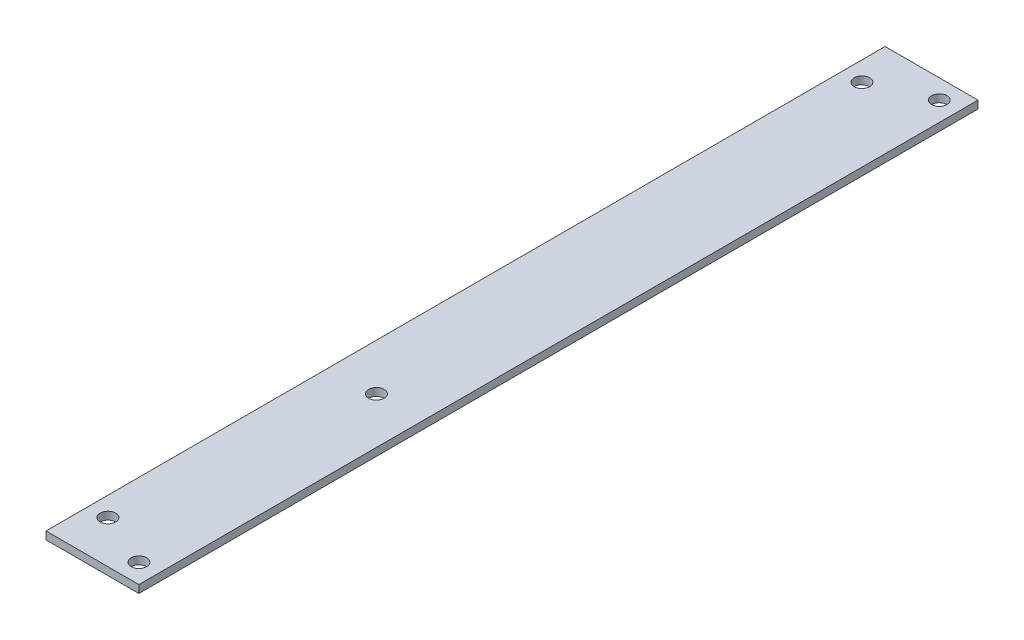
ISO-10303-21;
HEADER;
FILE_DESCRIPTION(('STEP AP214'),'2;1');
FILE_NAME('part.step','',(''),(''),'','','');
FILE_SCHEMA(('AUTOMOTIVE_DESIGN { 1 0 10303 214 1 1 1 1 }'));
ENDSEC;
DATA;
#1=APPLICATION_CONTEXT('core data for automotive mechanical design processes');
#2=APPLICATION_PROTOCOL_DEFINITION('international standard','automotive_design',2000,#1);
#3=PRODUCT_CONTEXT('',#1,'mechanical');
#4=PRODUCT('Part','Part','',(#3));
#5=PRODUCT_RELATED_PRODUCT_CATEGORY('part','',(#4));
#6=PRODUCT_DEFINITION_FORMATION('','',#4);
#7=PRODUCT_DEFINITION_CONTEXT('part definition',#1,'design');
#8=PRODUCT_DEFINITION('design','',#6,#7);
#9=PRODUCT_DEFINITION_SHAPE('','',#8);
#10=(LENGTH_UNIT() NAMED_UNIT(*) SI_UNIT(.MILLI.,.METRE.));
#11=(NAMED_UNIT(*) PLANE_ANGLE_UNIT() SI_UNIT($,.RADIAN.));
#12=(NAMED_UNIT(*) SI_UNIT($,.STERADIAN.) SOLID_ANGLE_UNIT());
#13=UNCERTAINTY_MEASURE_WITH_UNIT(LENGTH_MEASURE(1.E-05),#10,'distance_accuracy_value','');
#14=(GEOMETRIC_REPRESENTATION_CONTEXT(3) GLOBAL_UNCERTAINTY_ASSIGNED_CONTEXT((#13)) GLOBAL_UNIT_ASSIGNED_CONTEXT((#10,
#11,#12)) REPRESENTATION_CONTEXT('',''));
#15=CARTESIAN_POINT('',(0.,0.,0.));
#16=DIRECTION('',(0.,0.,1.));
#17=DIRECTION('',(1.,0.,0.));
#18=AXIS2_PLACEMENT_3D('',#15,#16,#17);
#19=CARTESIAN_POINT('',(38.1,0.,344.17));
#20=DIRECTION('',(0.,1.,0.));
#21=DIRECTION('',(-1.,0.,0.));
#22=AXIS2_PLACEMENT_3D('',#19,#20,#21);
#23=PLANE('',#22);
#24=CARTESIAN_POINT('',(30.1625,0.,336.2325));
#25=DIRECTION('',(0.,1.,0.));
#26=DIRECTION('',(-1.,0.,0.));
#27=AXIS2_PLACEMENT_3D('',#24,#25,#26);
#28=CIRCLE('',#27,3.175);
#29=CARTESIAN_POINT('',(26.9875,0.,336.2325));
#30=VERTEX_POINT('',#29);
#31=EDGE_CURVE('E112',#30,#30,#28,.T.);
#32=ORIENTED_EDGE('',*,*,#31,.T.);
#33=EDGE_LOOP('',(#32));
#34=FACE_BOUND('',#33,.T.);
#35=CARTESIAN_POINT('',(7.9375,0.,326.7075));
#36=DIRECTION('',(0.,1.,0.));
#37=DIRECTION('',(-1.,0.,0.));
#38=AXIS2_PLACEMENT_3D('',#35,#36,#37);
#39=CIRCLE('',#38,3.175);
#40=CARTESIAN_POINT('',(4.7625,0.,326.7075));
#41=VERTEX_POINT('',#40);
#42=EDGE_CURVE('E117',#41,#41,#39,.T.);
#43=ORIENTED_EDGE('',*,*,#42,.T.);
#44=EDGE_LOOP('',(#43));
#45=FACE_BOUND('',#44,.T.);
#46=CARTESIAN_POINT('',(7.9375,0.,17.4625));
#47=DIRECTION('',(0.,1.,0.));
#48=DIRECTION('',(-1.,0.,0.));
#49=AXIS2_PLACEMENT_3D('',#46,#47,#48);
#50=CIRCLE('',#49,3.175);
#51=CARTESIAN_POINT('',(4.7625,0.,17.4625));
#52=VERTEX_POINT('',#51);
#53=EDGE_CURVE('E120',#52,#52,#50,.T.);
#54=ORIENTED_EDGE('',*,*,#53,.T.);
#55=EDGE_LOOP('',(#54));
#56=FACE_BOUND('',#55,.T.);
#57=CARTESIAN_POINT('',(30.1625,0.,7.9375));
#58=DIRECTION('',(0.,1.,0.));
#59=DIRECTION('',(-1.,0.,0.));
#60=AXIS2_PLACEMENT_3D('',#57,#58,#59);
#61=CIRCLE('',#60,3.175);
#62=CARTESIAN_POINT('',(26.9875,0.,7.9375));
#63=VERTEX_POINT('',#62);
#64=EDGE_CURVE('E123',#63,#63,#61,.T.);
#65=ORIENTED_EDGE('',*,*,#64,.T.);
#66=EDGE_LOOP('',(#65));
#67=FACE_BOUND('',#66,.T.);
#68=CARTESIAN_POINT('',(19.05,0.,227.7075202));
#69=DIRECTION('',(0.,1.,0.));
#70=DIRECTION('',(0.,0.,1.));
#71=AXIS2_PLACEMENT_3D('',#68,#69,#70);
#72=CIRCLE('',#71,3.175);
#73=CARTESIAN_POINT('',(19.05,0.,230.8825202));
#74=VERTEX_POINT('',#73);
#75=EDGE_CURVE('E98',#74,#74,#72,.T.);
#76=ORIENTED_EDGE('',*,*,#75,.T.);
#77=EDGE_LOOP('',(#76));
#78=FACE_BOUND('',#77,.T.);
#79=DIRECTION('',(1.,0.,0.));
#80=VECTOR('',#79,1.);
#81=CARTESIAN_POINT('',(38.1,0.,0.));
#82=LINE('',#81,#80);
#83=CARTESIAN_POINT('',(0.,0.,0.));
#84=VERTEX_POINT('',#83);
#85=CARTESIAN_POINT('',(38.1,0.,0.));
#86=VERTEX_POINT('',#85);
#87=EDGE_CURVE('E95',#84,#86,#82,.T.);
#88=ORIENTED_EDGE('',*,*,#87,.T.);
#89=DIRECTION('',(0.,0.,-1.));
#90=VECTOR('',#89,1.);
#91=CARTESIAN_POINT('',(38.1,0.,344.17));
#92=LINE('',#91,#90);
#93=CARTESIAN_POINT('',(38.1,0.,344.17));
#94=VERTEX_POINT('',#93);
#95=EDGE_CURVE('E11',#94,#86,#92,.T.);
#96=ORIENTED_EDGE('',*,*,#95,.F.);
#97=DIRECTION('',(1.,0.,0.));
#98=VECTOR('',#97,1.);
#99=CARTESIAN_POINT('',(38.1,0.,344.17));
#100=LINE('',#99,#98);
#101=CARTESIAN_POINT('',(0.,0.,344.17));
#102=VERTEX_POINT('',#101);
#103=EDGE_CURVE('E83',#102,#94,#100,.T.);
#104=ORIENTED_EDGE('',*,*,#103,.F.);
#105=DIRECTION('',(0.,0.,-1.));
#106=VECTOR('',#105,1.);
#107=CARTESIAN_POINT('',(0.,0.,344.17));
#108=LINE('',#107,#106);
#109=EDGE_CURVE('E91',#102,#84,#108,.T.);
#110=ORIENTED_EDGE('',*,*,#109,.T.);
#111=EDGE_LOOP('',(#88,#96,#104,#110));
#112=FACE_BOUND('',#111,.T.);
#113=ADVANCED_FACE('F32',(#34,#45,#56,#67,#78,#112),#23,.F.);
#114=CARTESIAN_POINT('',(38.1,3.175,344.17));
#115=DIRECTION('',(-1.,0.,0.));
#116=DIRECTION('',(0.,0.,1.));
#117=AXIS2_PLACEMENT_3D('',#114,#115,#116);
#118=PLANE('',#117);
#119=DIRECTION('',(0.,1.,0.));
#120=VECTOR('',#119,1.);
#121=CARTESIAN_POINT('',(38.1,3.175,0.));
#122=LINE('',#121,#120);
#123=CARTESIAN_POINT('',(38.1,3.175,0.));
#124=VERTEX_POINT('',#123);
#125=EDGE_CURVE('E87',#86,#124,#122,.T.);
#126=ORIENTED_EDGE('',*,*,#125,.T.);
#127=DIRECTION('',(0.,0.,-1.));
#128=VECTOR('',#127,1.);
#129=CARTESIAN_POINT('',(38.1,3.175,344.17));
#130=LINE('',#129,#128);
#131=CARTESIAN_POINT('',(38.1,3.175,344.17));
#132=VERTEX_POINT('',#131);
#133=EDGE_CURVE('E40',#132,#124,#130,.T.);
#134=ORIENTED_EDGE('',*,*,#133,.F.);
#135=DIRECTION('',(0.,1.,0.));
#136=VECTOR('',#135,1.);
#137=CARTESIAN_POINT('',(38.1,3.175,344.17));
#138=LINE('',#137,#136);
#139=EDGE_CURVE('E78',#94,#132,#138,.T.);
#140=ORIENTED_EDGE('',*,*,#139,.F.);
#141=ORIENTED_EDGE('',*,*,#95,.T.);
#142=EDGE_LOOP('',(#126,#134,#140,#141));
#143=FACE_BOUND('',#142,.T.);
#144=ADVANCED_FACE('F86',(#143),#118,.F.);
#145=CARTESIAN_POINT('',(0.,3.175,344.17));
#146=DIRECTION('',(0.,-1.,0.));
#147=DIRECTION('',(0.,0.,-1.));
#148=AXIS2_PLACEMENT_3D('',#145,#146,#147);
#149=PLANE('',#148);
#150=CARTESIAN_POINT('',(30.1625,3.175,336.2325));
#151=DIRECTION('',(0.,-1.,0.));
#152=DIRECTION('',(0.,0.,-1.));
#153=AXIS2_PLACEMENT_3D('',#150,#151,#152);
#154=CIRCLE('',#153,3.175);
#155=CARTESIAN_POINT('',(30.1625,3.175,333.0575));
#156=VERTEX_POINT('',#155);
#157=EDGE_CURVE('E126',#156,#156,#154,.T.);
#158=ORIENTED_EDGE('',*,*,#157,.T.);
#159=EDGE_LOOP('',(#158));
#160=FACE_BOUND('',#159,.T.);
#161=CARTESIAN_POINT('',(7.9375,3.175,326.7075));
#162=DIRECTION('',(0.,-1.,0.));
#163=DIRECTION('',(0.,0.,-1.));
#164=AXIS2_PLACEMENT_3D('',#161,#162,#163);
#165=CIRCLE('',#164,3.175);
#166=CARTESIAN_POINT('',(7.9375,3.175,323.5325));
#167=VERTEX_POINT('',#166);
#168=EDGE_CURVE('E133',#167,#167,#165,.T.);
#169=ORIENTED_EDGE('',*,*,#168,.T.);
#170=EDGE_LOOP('',(#169));
#171=FACE_BOUND('',#170,.T.);
#172=CARTESIAN_POINT('',(7.9375,3.175,17.4625));
#173=DIRECTION('',(0.,-1.,0.));
#174=DIRECTION('',(0.,0.,-1.));
#175=AXIS2_PLACEMENT_3D('',#172,#173,#174);
#176=CIRCLE('',#175,3.175);
#177=CARTESIAN_POINT('',(7.9375,3.175,14.2875));
#178=VERTEX_POINT('',#177);
#179=EDGE_CURVE('E130',#178,#178,#176,.T.);
#180=ORIENTED_EDGE('',*,*,#179,.T.);
#181=EDGE_LOOP('',(#180));
#182=FACE_BOUND('',#181,.T.);
#183=CARTESIAN_POINT('',(30.1625,3.175,7.9375));
#184=DIRECTION('',(0.,-1.,0.));
#185=DIRECTION('',(0.,0.,-1.));
#186=AXIS2_PLACEMENT_3D('',#183,#184,#185);
#187=CIRCLE('',#186,3.175);
#188=CARTESIAN_POINT('',(30.1625,3.175,4.7625));
#189=VERTEX_POINT('',#188);
#190=EDGE_CURVE('E127',#189,#189,#187,.T.);
#191=ORIENTED_EDGE('',*,*,#190,.T.);
#192=EDGE_LOOP('',(#191));
#193=FACE_BOUND('',#192,.T.);
#194=CARTESIAN_POINT('',(19.05,3.175,227.7075202));
#195=DIRECTION('',(0.,1.,0.));
#196=DIRECTION('',(0.,0.,1.));
#197=AXIS2_PLACEMENT_3D('',#194,#195,#196);
#198=CIRCLE('',#197,3.175);
#199=CARTESIAN_POINT('',(19.05,3.175,230.8825202));
#200=VERTEX_POINT('',#199);
#201=EDGE_CURVE('E109',#200,#200,#198,.T.);
#202=ORIENTED_EDGE('',*,*,#201,.F.);
#203=EDGE_LOOP('',(#202));
#204=FACE_BOUND('',#203,.T.);
#205=DIRECTION('',(-1.,0.,0.));
#206=VECTOR('',#205,1.);
#207=CARTESIAN_POINT('',(0.,3.175,0.));
#208=LINE('',#207,#206);
#209=CARTESIAN_POINT('',(0.,3.175,0.));
#210=VERTEX_POINT('',#209);
#211=EDGE_CURVE('E65',#124,#210,#208,.T.);
#212=ORIENTED_EDGE('',*,*,#211,.T.);
#213=DIRECTION('',(0.,0.,-1.));
#214=VECTOR('',#213,1.);
#215=CARTESIAN_POINT('',(0.,3.175,344.17));
#216=LINE('',#215,#214);
#217=CARTESIAN_POINT('',(0.,3.175,344.17));
#218=VERTEX_POINT('',#217);
#219=EDGE_CURVE('E88',#218,#210,#216,.T.);
#220=ORIENTED_EDGE('',*,*,#219,.F.);
#221=DIRECTION('',(-1.,0.,0.));
#222=VECTOR('',#221,1.);
#223=CARTESIAN_POINT('',(0.,3.175,344.17));
#224=LINE('',#223,#222);
#225=EDGE_CURVE('E81',#132,#218,#224,.T.);
#226=ORIENTED_EDGE('',*,*,#225,.F.);
#227=ORIENTED_EDGE('',*,*,#133,.T.);
#228=EDGE_LOOP('',(#212,#220,#226,#227));
#229=FACE_BOUND('',#228,.T.);
#230=ADVANCED_FACE('F89',(#160,#171,#182,#193,#204,#229),#149,.F.);
#231=CARTESIAN_POINT('',(0.,0.,344.17));
#232=DIRECTION('',(1.,0.,0.));
#233=DIRECTION('',(0.,0.,-1.));
#234=AXIS2_PLACEMENT_3D('',#231,#232,#233);
#235=PLANE('',#234);
#236=DIRECTION('',(0.,-1.,0.));
#237=VECTOR('',#236,1.);
#238=CARTESIAN_POINT('',(0.,0.,0.));
#239=LINE('',#238,#237);
#240=EDGE_CURVE('E71',#210,#84,#239,.T.);
#241=ORIENTED_EDGE('',*,*,#240,.T.);
#242=ORIENTED_EDGE('',*,*,#109,.F.);
#243=DIRECTION('',(0.,-1.,0.));
#244=VECTOR('',#243,1.);
#245=CARTESIAN_POINT('',(0.,0.,344.17));
#246=LINE('',#245,#244);
#247=EDGE_CURVE('E48',#218,#102,#246,.T.);
#248=ORIENTED_EDGE('',*,*,#247,.F.);
#249=ORIENTED_EDGE('',*,*,#219,.T.);
#250=EDGE_LOOP('',(#241,#242,#248,#249));
#251=FACE_BOUND('',#250,.T.);
#252=ADVANCED_FACE('F103',(#251),#235,.F.);
#253=CARTESIAN_POINT('',(0.,0.,344.17));
#254=DIRECTION('',(0.,0.,-1.));
#255=DIRECTION('',(-1.,0.,0.));
#256=AXIS2_PLACEMENT_3D('',#253,#254,#255);
#257=PLANE('',#256);
#258=ORIENTED_EDGE('',*,*,#103,.T.);
#259=ORIENTED_EDGE('',*,*,#139,.T.);
#260=ORIENTED_EDGE('',*,*,#225,.T.);
#261=ORIENTED_EDGE('',*,*,#247,.T.);
#262=EDGE_LOOP('',(#258,#259,#260,#261));
#263=FACE_BOUND('',#262,.T.);
#264=ADVANCED_FACE('F79',(#263),#257,.F.);
#265=CARTESIAN_POINT('',(0.,0.,0.));
#266=DIRECTION('',(0.,0.,-1.));
#267=DIRECTION('',(-1.,0.,0.));
#268=AXIS2_PLACEMENT_3D('',#265,#266,#267);
#269=PLANE('',#268);
#270=ORIENTED_EDGE('',*,*,#87,.F.);
#271=ORIENTED_EDGE('',*,*,#240,.F.);
#272=ORIENTED_EDGE('',*,*,#211,.F.);
#273=ORIENTED_EDGE('',*,*,#125,.F.);
#274=EDGE_LOOP('',(#270,#271,#272,#273));
#275=FACE_BOUND('',#274,.T.);
#276=ADVANCED_FACE('F106',(#275),#269,.T.);
#277=CARTESIAN_POINT('',(19.05,0.,227.7075202));
#278=DIRECTION('',(0.,1.,0.));
#279=DIRECTION('',(0.,0.,1.));
#280=AXIS2_PLACEMENT_3D('',#277,#278,#279);
#281=CYLINDRICAL_SURFACE('',#280,3.175);
#282=ORIENTED_EDGE('',*,*,#75,.F.);
#283=EDGE_LOOP('',(#282));
#284=FACE_BOUND('',#283,.T.);
#285=ORIENTED_EDGE('',*,*,#201,.T.);
#286=EDGE_LOOP('',(#285));
#287=FACE_BOUND('',#286,.T.);
#288=ADVANCED_FACE('F158',(#284,#287),#281,.F.);
#289=CARTESIAN_POINT('',(30.1625,3.175,7.9375));
#290=DIRECTION('',(0.,-1.,0.));
#291=DIRECTION('',(0.,0.,-1.));
#292=AXIS2_PLACEMENT_3D('',#289,#290,#291);
#293=CYLINDRICAL_SURFACE('',#292,3.175);
#294=ORIENTED_EDGE('',*,*,#190,.F.);
#295=EDGE_LOOP('',(#294));
#296=FACE_BOUND('',#295,.T.);
#297=ORIENTED_EDGE('',*,*,#64,.F.);
#298=EDGE_LOOP('',(#297));
#299=FACE_BOUND('',#298,.T.);
#300=ADVANCED_FACE('F161',(#296,#299),#293,.F.);
#301=CARTESIAN_POINT('',(7.9375,3.175,17.4625));
#302=DIRECTION('',(0.,-1.,0.));
#303=DIRECTION('',(0.,0.,-1.));
#304=AXIS2_PLACEMENT_3D('',#301,#302,#303);
#305=CYLINDRICAL_SURFACE('',#304,3.175);
#306=ORIENTED_EDGE('',*,*,#179,.F.);
#307=EDGE_LOOP('',(#306));
#308=FACE_BOUND('',#307,.T.);
#309=ORIENTED_EDGE('',*,*,#53,.F.);
#310=EDGE_LOOP('',(#309));
#311=FACE_BOUND('',#310,.T.);
#312=ADVANCED_FACE('F179',(#308,#311),#305,.F.);
#313=CARTESIAN_POINT('',(7.9375,3.175,326.7075));
#314=DIRECTION('',(0.,-1.,0.));
#315=DIRECTION('',(0.,0.,-1.));
#316=AXIS2_PLACEMENT_3D('',#313,#314,#315);
#317=CYLINDRICAL_SURFACE('',#316,3.175);
#318=ORIENTED_EDGE('',*,*,#168,.F.);
#319=EDGE_LOOP('',(#318));
#320=FACE_BOUND('',#319,.T.);
#321=ORIENTED_EDGE('',*,*,#42,.F.);
#322=EDGE_LOOP('',(#321));
#323=FACE_BOUND('',#322,.T.);
#324=ADVANCED_FACE('F144',(#320,#323),#317,.F.);
#325=CARTESIAN_POINT('',(30.1625,3.175,336.2325));
#326=DIRECTION('',(0.,-1.,0.));
#327=DIRECTION('',(0.,0.,-1.));
#328=AXIS2_PLACEMENT_3D('',#325,#326,#327);
#329=CYLINDRICAL_SURFACE('',#328,3.175);
#330=ORIENTED_EDGE('',*,*,#157,.F.);
#331=EDGE_LOOP('',(#330));
#332=FACE_BOUND('',#331,.T.);
#333=ORIENTED_EDGE('',*,*,#31,.F.);
#334=EDGE_LOOP('',(#333));
#335=FACE_BOUND('',#334,.T.);
#336=ADVANCED_FACE('F141',(#332,#335),#329,.F.);
#337=CLOSED_SHELL('',(#113,#144,#230,#252,#264,#276,#288,#300,#312,#324,#336));
#338=MANIFOLD_SOLID_BREP('B2',#337);
#339=ADVANCED_BREP_SHAPE_REPRESENTATION('',(#18,#338),#14);
#340=SHAPE_DEFINITION_REPRESENTATION(#9,#339);
ENDSEC;
END-ISO-10303-21;
